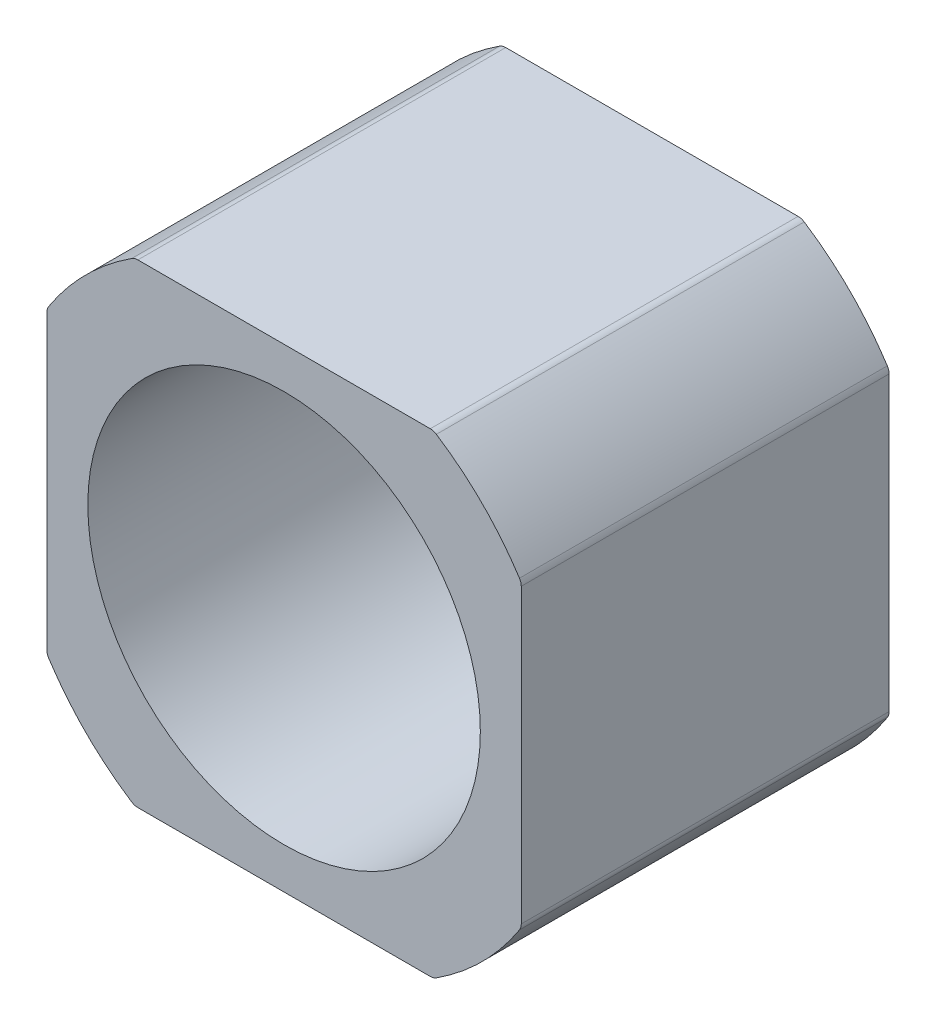
ISO-10303-21;
HEADER;
FILE_DESCRIPTION(('STEP AP214'),'2;1');
FILE_NAME('part.step','',(''),(''),'','','');
FILE_SCHEMA(('AUTOMOTIVE_DESIGN { 1 0 10303 214 1 1 1 1 }'));
ENDSEC;
DATA;
#1=APPLICATION_CONTEXT('core data for automotive mechanical design processes');
#2=APPLICATION_PROTOCOL_DEFINITION('international standard','automotive_design',2000,#1);
#3=PRODUCT_CONTEXT('',#1,'mechanical');
#4=PRODUCT('Part','Part','',(#3));
#5=PRODUCT_RELATED_PRODUCT_CATEGORY('part','',(#4));
#6=PRODUCT_DEFINITION_FORMATION('','',#4);
#7=PRODUCT_DEFINITION_CONTEXT('part definition',#1,'design');
#8=PRODUCT_DEFINITION('design','',#6,#7);
#9=PRODUCT_DEFINITION_SHAPE('','',#8);
#10=(LENGTH_UNIT() NAMED_UNIT(*) SI_UNIT(.MILLI.,.METRE.));
#11=(NAMED_UNIT(*) PLANE_ANGLE_UNIT() SI_UNIT($,.RADIAN.));
#12=(NAMED_UNIT(*) SI_UNIT($,.STERADIAN.) SOLID_ANGLE_UNIT());
#13=UNCERTAINTY_MEASURE_WITH_UNIT(LENGTH_MEASURE(1.E-05),#10,'distance_accuracy_value','');
#14=(GEOMETRIC_REPRESENTATION_CONTEXT(3) GLOBAL_UNCERTAINTY_ASSIGNED_CONTEXT((#13)) GLOBAL_UNIT_ASSIGNED_CONTEXT((#10,
#11,#12)) REPRESENTATION_CONTEXT('',''));
#15=CARTESIAN_POINT('',(0.,0.,0.));
#16=DIRECTION('',(0.,0.,1.));
#17=DIRECTION('',(1.,0.,0.));
#18=AXIS2_PLACEMENT_3D('',#15,#16,#17);
#19=CARTESIAN_POINT('',(21.15,21.15,32.8));
#20=DIRECTION('',(-1.,0.,0.));
#21=DIRECTION('',(0.,-1.,0.));
#22=AXIS2_PLACEMENT_3D('',#19,#20,#21);
#23=PLANE('',#22);
#24=DIRECTION('',(0.,1.,0.));
#25=VECTOR('',#24,1.);
#26=CARTESIAN_POINT('',(21.15,21.15,32.8));
#27=LINE('',#26,#25);
#28=CARTESIAN_POINT('',(21.15,-13.0375419462412,32.8));
#29=VERTEX_POINT('',#28);
#30=CARTESIAN_POINT('',(21.15,13.0375419462412,32.8));
#31=VERTEX_POINT('',#30);
#32=EDGE_CURVE('E225',#29,#31,#27,.T.);
#33=ORIENTED_EDGE('',*,*,#32,.F.);
#34=DIRECTION('',(0.,0.,-1.));
#35=VECTOR('',#34,1.);
#36=CARTESIAN_POINT('',(21.15,-13.0375419462412,0.));
#37=LINE('',#36,#35);
#38=CARTESIAN_POINT('',(21.15,-13.0375419462412,0.));
#39=VERTEX_POINT('',#38);
#40=EDGE_CURVE('E308',#29,#39,#37,.T.);
#41=ORIENTED_EDGE('',*,*,#40,.T.);
#42=DIRECTION('',(0.,1.,0.));
#43=VECTOR('',#42,1.);
#44=CARTESIAN_POINT('',(21.15,21.15,0.));
#45=LINE('',#44,#43);
#46=CARTESIAN_POINT('',(21.15,13.0375419462412,0.));
#47=VERTEX_POINT('',#46);
#48=EDGE_CURVE('E211',#39,#47,#45,.T.);
#49=ORIENTED_EDGE('',*,*,#48,.T.);
#50=DIRECTION('',(0.,0.,-1.));
#51=VECTOR('',#50,1.);
#52=CARTESIAN_POINT('',(21.15,13.0375419462412,32.8));
#53=LINE('',#52,#51);
#54=EDGE_CURVE('E305',#47,#31,#53,.F.);
#55=ORIENTED_EDGE('',*,*,#54,.T.);
#56=EDGE_LOOP('',(#33,#41,#49,#55));
#57=FACE_BOUND('',#56,.T.);
#58=ADVANCED_FACE('F39',(#57),#23,.F.);
#59=CARTESIAN_POINT('',(-21.15,21.15,32.8));
#60=DIRECTION('',(0.,-1.,0.));
#61=DIRECTION('',(1.,0.,0.));
#62=AXIS2_PLACEMENT_3D('',#59,#60,#61);
#63=PLANE('',#62);
#64=DIRECTION('',(-1.,0.,0.));
#65=VECTOR('',#64,1.);
#66=CARTESIAN_POINT('',(-21.15,21.15,0.));
#67=LINE('',#66,#65);
#68=CARTESIAN_POINT('',(13.0375419462413,21.15,0.));
#69=VERTEX_POINT('',#68);
#70=CARTESIAN_POINT('',(-13.0375419462413,21.15,0.));
#71=VERTEX_POINT('',#70);
#72=EDGE_CURVE('E215',#69,#71,#67,.T.);
#73=ORIENTED_EDGE('',*,*,#72,.T.);
#74=DIRECTION('',(0.,0.,-1.));
#75=VECTOR('',#74,1.);
#76=CARTESIAN_POINT('',(-13.0375419462413,21.15,32.8));
#77=LINE('',#76,#75);
#78=CARTESIAN_POINT('',(-13.0375419462413,21.15,32.8));
#79=VERTEX_POINT('',#78);
#80=EDGE_CURVE('E161',#71,#79,#77,.F.);
#81=ORIENTED_EDGE('',*,*,#80,.T.);
#82=DIRECTION('',(-1.,0.,0.));
#83=VECTOR('',#82,1.);
#84=CARTESIAN_POINT('',(-21.15,21.15,32.8));
#85=LINE('',#84,#83);
#86=CARTESIAN_POINT('',(13.0375419462413,21.15,32.8));
#87=VERTEX_POINT('',#86);
#88=EDGE_CURVE('E207',#87,#79,#85,.T.);
#89=ORIENTED_EDGE('',*,*,#88,.F.);
#90=DIRECTION('',(0.,0.,-1.));
#91=VECTOR('',#90,1.);
#92=CARTESIAN_POINT('',(13.0375419462413,21.15,0.));
#93=LINE('',#92,#91);
#94=EDGE_CURVE('E167',#87,#69,#93,.T.);
#95=ORIENTED_EDGE('',*,*,#94,.T.);
#96=EDGE_LOOP('',(#73,#81,#89,#95));
#97=FACE_BOUND('',#96,.T.);
#98=ADVANCED_FACE('F375',(#97),#63,.F.);
#99=CARTESIAN_POINT('',(-21.15,21.15,32.8));
#100=DIRECTION('',(1.,0.,0.));
#101=DIRECTION('',(0.,0.,-1.));
#102=AXIS2_PLACEMENT_3D('',#99,#100,#101);
#103=PLANE('',#102);
#104=DIRECTION('',(0.,-1.,0.));
#105=VECTOR('',#104,1.);
#106=CARTESIAN_POINT('',(-21.15,21.15,32.8));
#107=LINE('',#106,#105);
#108=CARTESIAN_POINT('',(-21.15,13.0375419462413,32.8));
#109=VERTEX_POINT('',#108);
#110=CARTESIAN_POINT('',(-21.15,-13.0375419462413,32.8));
#111=VERTEX_POINT('',#110);
#112=EDGE_CURVE('E202',#109,#111,#107,.T.);
#113=ORIENTED_EDGE('',*,*,#112,.F.);
#114=DIRECTION('',(0.,0.,-1.));
#115=VECTOR('',#114,1.);
#116=CARTESIAN_POINT('',(-21.15,13.0375419462413,0.));
#117=LINE('',#116,#115);
#118=CARTESIAN_POINT('',(-21.15,13.0375419462413,0.));
#119=VERTEX_POINT('',#118);
#120=EDGE_CURVE('E277',#109,#119,#117,.T.);
#121=ORIENTED_EDGE('',*,*,#120,.T.);
#122=DIRECTION('',(0.,-1.,0.));
#123=VECTOR('',#122,1.);
#124=CARTESIAN_POINT('',(-21.15,21.15,0.));
#125=LINE('',#124,#123);
#126=CARTESIAN_POINT('',(-21.15,-13.0375419462413,0.));
#127=VERTEX_POINT('',#126);
#128=EDGE_CURVE('E219',#119,#127,#125,.T.);
#129=ORIENTED_EDGE('',*,*,#128,.T.);
#130=DIRECTION('',(0.,0.,-1.));
#131=VECTOR('',#130,1.);
#132=CARTESIAN_POINT('',(-21.15,-13.0375419462413,32.8));
#133=LINE('',#132,#131);
#134=EDGE_CURVE('E272',#127,#111,#133,.F.);
#135=ORIENTED_EDGE('',*,*,#134,.T.);
#136=EDGE_LOOP('',(#113,#121,#129,#135));
#137=FACE_BOUND('',#136,.T.);
#138=ADVANCED_FACE('F377',(#137),#103,.F.);
#139=CARTESIAN_POINT('',(-21.15,-21.15,32.8));
#140=DIRECTION('',(0.,1.,0.));
#141=DIRECTION('',(0.,0.,1.));
#142=AXIS2_PLACEMENT_3D('',#139,#140,#141);
#143=PLANE('',#142);
#144=DIRECTION('',(1.,0.,0.));
#145=VECTOR('',#144,1.);
#146=CARTESIAN_POINT('',(-21.15,-21.15,32.8));
#147=LINE('',#146,#145);
#148=CARTESIAN_POINT('',(-13.0375419462412,-21.15,32.8));
#149=VERTEX_POINT('',#148);
#150=CARTESIAN_POINT('',(13.0375419462412,-21.15,32.8));
#151=VERTEX_POINT('',#150);
#152=EDGE_CURVE('E197',#149,#151,#147,.T.);
#153=ORIENTED_EDGE('',*,*,#152,.F.);
#154=DIRECTION('',(0.,0.,-1.));
#155=VECTOR('',#154,1.);
#156=CARTESIAN_POINT('',(-13.0375419462412,-21.15,0.));
#157=LINE('',#156,#155);
#158=CARTESIAN_POINT('',(-13.0375419462412,-21.15,0.));
#159=VERTEX_POINT('',#158);
#160=EDGE_CURVE('E296',#149,#159,#157,.T.);
#161=ORIENTED_EDGE('',*,*,#160,.T.);
#162=DIRECTION('',(1.,0.,0.));
#163=VECTOR('',#162,1.);
#164=CARTESIAN_POINT('',(-21.15,-21.15,0.));
#165=LINE('',#164,#163);
#166=CARTESIAN_POINT('',(13.0375419462412,-21.15,0.));
#167=VERTEX_POINT('',#166);
#168=EDGE_CURVE('E222',#159,#167,#165,.T.);
#169=ORIENTED_EDGE('',*,*,#168,.T.);
#170=DIRECTION('',(0.,0.,-1.));
#171=VECTOR('',#170,1.);
#172=CARTESIAN_POINT('',(13.0375419462412,-21.15,32.8));
#173=LINE('',#172,#171);
#174=EDGE_CURVE('E293',#167,#151,#173,.F.);
#175=ORIENTED_EDGE('',*,*,#174,.T.);
#176=EDGE_LOOP('',(#153,#161,#169,#175));
#177=FACE_BOUND('',#176,.T.);
#178=ADVANCED_FACE('F263',(#177),#143,.F.);
#179=CARTESIAN_POINT('',(0.,0.,32.8));
#180=DIRECTION('',(0.,0.,1.));
#181=DIRECTION('',(1.,0.,0.));
#182=AXIS2_PLACEMENT_3D('',#179,#180,#181);
#183=PLANE('',#182);
#184=CARTESIAN_POINT('',(0.,0.,32.8));
#185=DIRECTION('',(0.,0.,1.));
#186=DIRECTION('',(1.,0.,0.));
#187=AXIS2_PLACEMENT_3D('',#184,#185,#186);
#188=CIRCLE('',#187,17.5);
#189=CARTESIAN_POINT('',(17.5,0.,32.8));
#190=VERTEX_POINT('',#189);
#191=EDGE_CURVE('E246',#190,#190,#188,.T.);
#192=ORIENTED_EDGE('',*,*,#191,.F.);
#193=EDGE_LOOP('',(#192));
#194=FACE_BOUND('',#193,.T.);
#195=ORIENTED_EDGE('',*,*,#88,.T.);
#196=CARTESIAN_POINT('',(-13.0375419462413,20.15,32.8));
#197=DIRECTION('',(0.,0.,1.));
#198=DIRECTION('',(1.,0.,0.));
#199=AXIS2_PLACEMENT_3D('',#196,#197,#198);
#200=CIRCLE('',#199,1.);
#201=CARTESIAN_POINT('',(-13.580772860668,20.9895833333333,32.8));
#202=VERTEX_POINT('',#201);
#203=EDGE_CURVE('E266',#79,#202,#200,.T.);
#204=ORIENTED_EDGE('',*,*,#203,.T.);
#205=CARTESIAN_POINT('',(0.,0.,32.8));
#206=DIRECTION('',(0.,0.,1.));
#207=DIRECTION('',(1.,0.,0.));
#208=AXIS2_PLACEMENT_3D('',#205,#206,#207);
#209=CIRCLE('',#208,25.);
#210=CARTESIAN_POINT('',(-20.9895833333333,13.580772860668,32.8));
#211=VERTEX_POINT('',#210);
#212=EDGE_CURVE('E178',#202,#211,#209,.T.);
#213=ORIENTED_EDGE('',*,*,#212,.T.);
#214=CARTESIAN_POINT('',(-20.15,13.0375419462413,32.8));
#215=DIRECTION('',(0.,0.,1.));
#216=DIRECTION('',(1.,0.,0.));
#217=AXIS2_PLACEMENT_3D('',#214,#215,#216);
#218=CIRCLE('',#217,1.);
#219=EDGE_CURVE('E273',#211,#109,#218,.T.);
#220=ORIENTED_EDGE('',*,*,#219,.T.);
#221=ORIENTED_EDGE('',*,*,#112,.T.);
#222=CARTESIAN_POINT('',(-20.15,-13.0375419462413,32.8));
#223=DIRECTION('',(0.,0.,1.));
#224=DIRECTION('',(1.,0.,0.));
#225=AXIS2_PLACEMENT_3D('',#222,#223,#224);
#226=CIRCLE('',#225,1.);
#227=CARTESIAN_POINT('',(-20.9895833333333,-13.580772860668,32.8));
#228=VERTEX_POINT('',#227);
#229=EDGE_CURVE('E279',#111,#228,#226,.T.);
#230=ORIENTED_EDGE('',*,*,#229,.T.);
#231=CARTESIAN_POINT('',(-13.580772860668,-20.9895833333333,32.8));
#232=VERTEX_POINT('',#231);
#233=EDGE_CURVE('E240',#228,#232,#209,.T.);
#234=ORIENTED_EDGE('',*,*,#233,.T.);
#235=CARTESIAN_POINT('',(-13.0375419462412,-20.15,32.8));
#236=DIRECTION('',(0.,0.,1.));
#237=DIRECTION('',(1.,0.,0.));
#238=AXIS2_PLACEMENT_3D('',#235,#236,#237);
#239=CIRCLE('',#238,1.);
#240=EDGE_CURVE('E326',#232,#149,#239,.T.);
#241=ORIENTED_EDGE('',*,*,#240,.T.);
#242=ORIENTED_EDGE('',*,*,#152,.T.);
#243=CARTESIAN_POINT('',(13.0375419462412,-20.15,32.8));
#244=DIRECTION('',(0.,0.,1.));
#245=DIRECTION('',(1.,0.,0.));
#246=AXIS2_PLACEMENT_3D('',#243,#244,#245);
#247=CIRCLE('',#246,1.);
#248=CARTESIAN_POINT('',(13.580772860668,-20.9895833333333,32.8));
#249=VERTEX_POINT('',#248);
#250=EDGE_CURVE('E63',#151,#249,#247,.T.);
#251=ORIENTED_EDGE('',*,*,#250,.T.);
#252=CARTESIAN_POINT('',(20.9895833333333,-13.580772860668,32.8));
#253=VERTEX_POINT('',#252);
#254=EDGE_CURVE('E237',#249,#253,#209,.T.);
#255=ORIENTED_EDGE('',*,*,#254,.T.);
#256=CARTESIAN_POINT('',(20.15,-13.0375419462412,32.8));
#257=DIRECTION('',(0.,0.,1.));
#258=DIRECTION('',(1.,0.,0.));
#259=AXIS2_PLACEMENT_3D('',#256,#257,#258);
#260=CIRCLE('',#259,1.);
#261=EDGE_CURVE('E55',#253,#29,#260,.T.);
#262=ORIENTED_EDGE('',*,*,#261,.T.);
#263=ORIENTED_EDGE('',*,*,#32,.T.);
#264=CARTESIAN_POINT('',(20.15,13.0375419462412,32.8));
#265=DIRECTION('',(0.,0.,1.));
#266=DIRECTION('',(1.,0.,0.));
#267=AXIS2_PLACEMENT_3D('',#264,#265,#266);
#268=CIRCLE('',#267,1.);
#269=CARTESIAN_POINT('',(20.9895833333333,13.580772860668,32.8));
#270=VERTEX_POINT('',#269);
#271=EDGE_CURVE('E320',#31,#270,#268,.T.);
#272=ORIENTED_EDGE('',*,*,#271,.T.);
#273=CARTESIAN_POINT('',(13.580772860668,20.9895833333333,32.8));
#274=VERTEX_POINT('',#273);
#275=EDGE_CURVE('E245',#270,#274,#209,.T.);
#276=ORIENTED_EDGE('',*,*,#275,.T.);
#277=CARTESIAN_POINT('',(13.0375419462413,20.15,32.8));
#278=DIRECTION('',(0.,0.,1.));
#279=DIRECTION('',(1.,0.,0.));
#280=AXIS2_PLACEMENT_3D('',#277,#278,#279);
#281=CIRCLE('',#280,1.);
#282=EDGE_CURVE('E268',#274,#87,#281,.T.);
#283=ORIENTED_EDGE('',*,*,#282,.T.);
#284=EDGE_LOOP('',(#195,#204,#213,#220,#221,#230,#234,#241,#242,#251,#255,#262,#263,#272,#276,#283));
#285=FACE_BOUND('',#284,.T.);
#286=ADVANCED_FACE('F261',(#194,#285),#183,.T.);
#287=CARTESIAN_POINT('',(0.,0.,0.));
#288=DIRECTION('',(0.,0.,1.));
#289=DIRECTION('',(1.,0.,0.));
#290=AXIS2_PLACEMENT_3D('',#287,#288,#289);
#291=PLANE('',#290);
#292=CARTESIAN_POINT('',(0.,0.,0.));
#293=DIRECTION('',(0.,0.,1.));
#294=DIRECTION('',(1.,0.,0.));
#295=AXIS2_PLACEMENT_3D('',#292,#293,#294);
#296=CIRCLE('',#295,17.5);
#297=CARTESIAN_POINT('',(17.5,0.,0.));
#298=VERTEX_POINT('',#297);
#299=EDGE_CURVE('E241',#298,#298,#296,.T.);
#300=ORIENTED_EDGE('',*,*,#299,.T.);
#301=EDGE_LOOP('',(#300));
#302=FACE_BOUND('',#301,.T.);
#303=CARTESIAN_POINT('',(0.,0.,0.));
#304=DIRECTION('',(0.,0.,1.));
#305=DIRECTION('',(1.,0.,0.));
#306=AXIS2_PLACEMENT_3D('',#303,#304,#305);
#307=CIRCLE('',#306,25.);
#308=CARTESIAN_POINT('',(-13.580772860668,20.9895833333333,0.));
#309=VERTEX_POINT('',#308);
#310=CARTESIAN_POINT('',(-20.9895833333333,13.580772860668,0.));
#311=VERTEX_POINT('',#310);
#312=EDGE_CURVE('E175',#309,#311,#307,.T.);
#313=ORIENTED_EDGE('',*,*,#312,.F.);
#314=CARTESIAN_POINT('',(-13.0375419462413,20.15,0.));
#315=DIRECTION('',(0.,0.,1.));
#316=DIRECTION('',(1.,0.,0.));
#317=AXIS2_PLACEMENT_3D('',#314,#315,#316);
#318=CIRCLE('',#317,1.);
#319=EDGE_CURVE('E156',#309,#71,#318,.F.);
#320=ORIENTED_EDGE('',*,*,#319,.T.);
#321=ORIENTED_EDGE('',*,*,#72,.F.);
#322=CARTESIAN_POINT('',(13.0375419462413,20.15,0.));
#323=DIRECTION('',(0.,0.,1.));
#324=DIRECTION('',(1.,0.,0.));
#325=AXIS2_PLACEMENT_3D('',#322,#323,#324);
#326=CIRCLE('',#325,1.);
#327=CARTESIAN_POINT('',(13.580772860668,20.9895833333333,0.));
#328=VERTEX_POINT('',#327);
#329=EDGE_CURVE('E180',#69,#328,#326,.F.);
#330=ORIENTED_EDGE('',*,*,#329,.T.);
#331=CARTESIAN_POINT('',(0.,0.,0.));
#332=DIRECTION('',(0.,0.,1.));
#333=DIRECTION('',(1.,0.,0.));
#334=AXIS2_PLACEMENT_3D('',#331,#332,#333);
#335=CIRCLE('',#334,25.);
#336=CARTESIAN_POINT('',(20.9895833333333,13.580772860668,0.));
#337=VERTEX_POINT('',#336);
#338=EDGE_CURVE('E216',#337,#328,#335,.T.);
#339=ORIENTED_EDGE('',*,*,#338,.F.);
#340=CARTESIAN_POINT('',(20.15,13.0375419462412,0.));
#341=DIRECTION('',(0.,0.,1.));
#342=DIRECTION('',(1.,0.,0.));
#343=AXIS2_PLACEMENT_3D('',#340,#341,#342);
#344=CIRCLE('',#343,1.);
#345=EDGE_CURVE('E368',#337,#47,#344,.F.);
#346=ORIENTED_EDGE('',*,*,#345,.T.);
#347=ORIENTED_EDGE('',*,*,#48,.F.);
#348=CARTESIAN_POINT('',(20.15,-13.0375419462412,0.));
#349=DIRECTION('',(0.,0.,1.));
#350=DIRECTION('',(1.,0.,0.));
#351=AXIS2_PLACEMENT_3D('',#348,#349,#350);
#352=CIRCLE('',#351,1.);
#353=CARTESIAN_POINT('',(20.9895833333333,-13.580772860668,0.));
#354=VERTEX_POINT('',#353);
#355=EDGE_CURVE('E366',#39,#354,#352,.F.);
#356=ORIENTED_EDGE('',*,*,#355,.T.);
#357=CARTESIAN_POINT('',(13.580772860668,-20.9895833333333,0.));
#358=VERTEX_POINT('',#357);
#359=EDGE_CURVE('E189',#358,#354,#307,.T.);
#360=ORIENTED_EDGE('',*,*,#359,.F.);
#361=CARTESIAN_POINT('',(13.0375419462412,-20.15,0.));
#362=DIRECTION('',(0.,0.,1.));
#363=DIRECTION('',(1.,0.,0.));
#364=AXIS2_PLACEMENT_3D('',#361,#362,#363);
#365=CIRCLE('',#364,1.);
#366=EDGE_CURVE('E343',#358,#167,#365,.F.);
#367=ORIENTED_EDGE('',*,*,#366,.T.);
#368=ORIENTED_EDGE('',*,*,#168,.F.);
#369=CARTESIAN_POINT('',(-13.0375419462412,-20.15,0.));
#370=DIRECTION('',(0.,0.,1.));
#371=DIRECTION('',(1.,0.,0.));
#372=AXIS2_PLACEMENT_3D('',#369,#370,#371);
#373=CIRCLE('',#372,1.);
#374=CARTESIAN_POINT('',(-13.580772860668,-20.9895833333333,0.));
#375=VERTEX_POINT('',#374);
#376=EDGE_CURVE('E338',#159,#375,#373,.F.);
#377=ORIENTED_EDGE('',*,*,#376,.T.);
#378=CARTESIAN_POINT('',(-20.9895833333333,-13.580772860668,0.));
#379=VERTEX_POINT('',#378);
#380=EDGE_CURVE('E187',#379,#375,#307,.T.);
#381=ORIENTED_EDGE('',*,*,#380,.F.);
#382=CARTESIAN_POINT('',(-20.15,-13.0375419462413,0.));
#383=DIRECTION('',(0.,0.,1.));
#384=DIRECTION('',(1.,0.,0.));
#385=AXIS2_PLACEMENT_3D('',#382,#383,#384);
#386=CIRCLE('',#385,1.);
#387=EDGE_CURVE('E336',#379,#127,#386,.F.);
#388=ORIENTED_EDGE('',*,*,#387,.T.);
#389=ORIENTED_EDGE('',*,*,#128,.F.);
#390=CARTESIAN_POINT('',(-20.15,13.0375419462413,0.));
#391=DIRECTION('',(0.,0.,1.));
#392=DIRECTION('',(1.,0.,0.));
#393=AXIS2_PLACEMENT_3D('',#390,#391,#392);
#394=CIRCLE('',#393,1.);
#395=EDGE_CURVE('E168',#119,#311,#394,.F.);
#396=ORIENTED_EDGE('',*,*,#395,.T.);
#397=EDGE_LOOP('',(#313,#320,#321,#330,#339,#346,#347,#356,#360,#367,#368,#377,#381,#388,#389,#396));
#398=FACE_BOUND('',#397,.T.);
#399=ADVANCED_FACE('F183',(#302,#398),#291,.F.);
#400=CARTESIAN_POINT('',(0.,0.,0.));
#401=DIRECTION('',(0.,0.,1.));
#402=DIRECTION('',(1.,0.,0.));
#403=AXIS2_PLACEMENT_3D('',#400,#401,#402);
#404=CYLINDRICAL_SURFACE('',#403,25.);
#405=ORIENTED_EDGE('',*,*,#254,.F.);
#406=DIRECTION('',(0.,0.,1.));
#407=VECTOR('',#406,1.);
#408=CARTESIAN_POINT('',(13.580772860668,-20.9895833333333,0.));
#409=LINE('',#408,#407);
#410=EDGE_CURVE('E302',#249,#358,#409,.F.);
#411=ORIENTED_EDGE('',*,*,#410,.T.);
#412=ORIENTED_EDGE('',*,*,#359,.T.);
#413=DIRECTION('',(0.,0.,1.));
#414=VECTOR('',#413,1.);
#415=CARTESIAN_POINT('',(20.9895833333333,-13.580772860668,0.));
#416=LINE('',#415,#414);
#417=EDGE_CURVE('E299',#354,#253,#416,.T.);
#418=ORIENTED_EDGE('',*,*,#417,.T.);
#419=EDGE_LOOP('',(#405,#411,#412,#418));
#420=FACE_BOUND('',#419,.T.);
#421=ADVANCED_FACE('F426',(#420),#404,.T.);
#422=ORIENTED_EDGE('',*,*,#233,.F.);
#423=DIRECTION('',(0.,0.,1.));
#424=VECTOR('',#423,1.);
#425=CARTESIAN_POINT('',(-20.9895833333333,-13.580772860668,0.));
#426=LINE('',#425,#424);
#427=EDGE_CURVE('E289',#228,#379,#426,.F.);
#428=ORIENTED_EDGE('',*,*,#427,.T.);
#429=ORIENTED_EDGE('',*,*,#380,.T.);
#430=DIRECTION('',(0.,0.,1.));
#431=VECTOR('',#430,1.);
#432=CARTESIAN_POINT('',(-13.580772860668,-20.9895833333333,0.));
#433=LINE('',#432,#431);
#434=EDGE_CURVE('E285',#375,#232,#433,.T.);
#435=ORIENTED_EDGE('',*,*,#434,.T.);
#436=EDGE_LOOP('',(#422,#428,#429,#435));
#437=FACE_BOUND('',#436,.T.);
#438=ADVANCED_FACE('F330',(#437),#404,.T.);
#439=ORIENTED_EDGE('',*,*,#212,.F.);
#440=DIRECTION('',(0.,0.,1.));
#441=VECTOR('',#440,1.);
#442=CARTESIAN_POINT('',(-13.580772860668,20.9895833333333,0.));
#443=LINE('',#442,#441);
#444=EDGE_CURVE('E160',#202,#309,#443,.F.);
#445=ORIENTED_EDGE('',*,*,#444,.T.);
#446=ORIENTED_EDGE('',*,*,#312,.T.);
#447=DIRECTION('',(0.,0.,1.));
#448=VECTOR('',#447,1.);
#449=CARTESIAN_POINT('',(-20.9895833333333,13.580772860668,0.));
#450=LINE('',#449,#448);
#451=EDGE_CURVE('E181',#311,#211,#450,.T.);
#452=ORIENTED_EDGE('',*,*,#451,.T.);
#453=EDGE_LOOP('',(#439,#445,#446,#452));
#454=FACE_BOUND('',#453,.T.);
#455=ADVANCED_FACE('F173',(#454),#404,.T.);
#456=ORIENTED_EDGE('',*,*,#275,.F.);
#457=DIRECTION('',(0.,0.,1.));
#458=VECTOR('',#457,1.);
#459=CARTESIAN_POINT('',(20.9895833333333,13.580772860668,0.));
#460=LINE('',#459,#458);
#461=EDGE_CURVE('E11',#270,#337,#460,.F.);
#462=ORIENTED_EDGE('',*,*,#461,.T.);
#463=ORIENTED_EDGE('',*,*,#338,.T.);
#464=DIRECTION('',(0.,0.,1.));
#465=VECTOR('',#464,1.);
#466=CARTESIAN_POINT('',(13.580772860668,20.9895833333333,0.));
#467=LINE('',#466,#465);
#468=EDGE_CURVE('E48',#328,#274,#467,.T.);
#469=ORIENTED_EDGE('',*,*,#468,.T.);
#470=EDGE_LOOP('',(#456,#462,#463,#469));
#471=FACE_BOUND('',#470,.T.);
#472=ADVANCED_FACE('F315',(#471),#404,.T.);
#473=CARTESIAN_POINT('',(-13.0375419462413,20.15,0.));
#474=DIRECTION('',(0.,0.,1.));
#475=DIRECTION('',(1.,0.,0.));
#476=AXIS2_PLACEMENT_3D('',#473,#474,#475);
#477=CYLINDRICAL_SURFACE('',#476,1.);
#478=ORIENTED_EDGE('',*,*,#203,.F.);
#479=ORIENTED_EDGE('',*,*,#80,.F.);
#480=ORIENTED_EDGE('',*,*,#319,.F.);
#481=ORIENTED_EDGE('',*,*,#444,.F.);
#482=EDGE_LOOP('',(#478,#479,#480,#481));
#483=FACE_BOUND('',#482,.T.);
#484=ADVANCED_FACE('F159',(#483),#477,.T.);
#485=CARTESIAN_POINT('',(-20.15,13.0375419462413,0.));
#486=DIRECTION('',(0.,0.,1.));
#487=DIRECTION('',(1.,0.,0.));
#488=AXIS2_PLACEMENT_3D('',#485,#486,#487);
#489=CYLINDRICAL_SURFACE('',#488,1.);
#490=ORIENTED_EDGE('',*,*,#395,.F.);
#491=ORIENTED_EDGE('',*,*,#120,.F.);
#492=ORIENTED_EDGE('',*,*,#219,.F.);
#493=ORIENTED_EDGE('',*,*,#451,.F.);
#494=EDGE_LOOP('',(#490,#491,#492,#493));
#495=FACE_BOUND('',#494,.T.);
#496=ADVANCED_FACE('F390',(#495),#489,.T.);
#497=CARTESIAN_POINT('',(-20.15,-13.0375419462413,0.));
#498=DIRECTION('',(0.,0.,1.));
#499=DIRECTION('',(1.,0.,0.));
#500=AXIS2_PLACEMENT_3D('',#497,#498,#499);
#501=CYLINDRICAL_SURFACE('',#500,1.);
#502=ORIENTED_EDGE('',*,*,#229,.F.);
#503=ORIENTED_EDGE('',*,*,#134,.F.);
#504=ORIENTED_EDGE('',*,*,#387,.F.);
#505=ORIENTED_EDGE('',*,*,#427,.F.);
#506=EDGE_LOOP('',(#502,#503,#504,#505));
#507=FACE_BOUND('',#506,.T.);
#508=ADVANCED_FACE('F334',(#507),#501,.T.);
#509=CARTESIAN_POINT('',(-13.0375419462412,-20.15,0.));
#510=DIRECTION('',(0.,0.,1.));
#511=DIRECTION('',(1.,0.,0.));
#512=AXIS2_PLACEMENT_3D('',#509,#510,#511);
#513=CYLINDRICAL_SURFACE('',#512,1.);
#514=ORIENTED_EDGE('',*,*,#376,.F.);
#515=ORIENTED_EDGE('',*,*,#160,.F.);
#516=ORIENTED_EDGE('',*,*,#240,.F.);
#517=ORIENTED_EDGE('',*,*,#434,.F.);
#518=EDGE_LOOP('',(#514,#515,#516,#517));
#519=FACE_BOUND('',#518,.T.);
#520=ADVANCED_FACE('F396',(#519),#513,.T.);
#521=CARTESIAN_POINT('',(13.0375419462412,-20.15,0.));
#522=DIRECTION('',(0.,0.,1.));
#523=DIRECTION('',(1.,0.,0.));
#524=AXIS2_PLACEMENT_3D('',#521,#522,#523);
#525=CYLINDRICAL_SURFACE('',#524,1.);
#526=ORIENTED_EDGE('',*,*,#250,.F.);
#527=ORIENTED_EDGE('',*,*,#174,.F.);
#528=ORIENTED_EDGE('',*,*,#366,.F.);
#529=ORIENTED_EDGE('',*,*,#410,.F.);
#530=EDGE_LOOP('',(#526,#527,#528,#529));
#531=FACE_BOUND('',#530,.T.);
#532=ADVANCED_FACE('F399',(#531),#525,.T.);
#533=CARTESIAN_POINT('',(20.15,-13.0375419462412,0.));
#534=DIRECTION('',(0.,0.,1.));
#535=DIRECTION('',(1.,0.,0.));
#536=AXIS2_PLACEMENT_3D('',#533,#534,#535);
#537=CYLINDRICAL_SURFACE('',#536,1.);
#538=ORIENTED_EDGE('',*,*,#355,.F.);
#539=ORIENTED_EDGE('',*,*,#40,.F.);
#540=ORIENTED_EDGE('',*,*,#261,.F.);
#541=ORIENTED_EDGE('',*,*,#417,.F.);
#542=EDGE_LOOP('',(#538,#539,#540,#541));
#543=FACE_BOUND('',#542,.T.);
#544=ADVANCED_FACE('F365',(#543),#537,.T.);
#545=CARTESIAN_POINT('',(20.15,13.0375419462412,0.));
#546=DIRECTION('',(0.,0.,1.));
#547=DIRECTION('',(1.,0.,0.));
#548=AXIS2_PLACEMENT_3D('',#545,#546,#547);
#549=CYLINDRICAL_SURFACE('',#548,1.);
#550=ORIENTED_EDGE('',*,*,#271,.F.);
#551=ORIENTED_EDGE('',*,*,#54,.F.);
#552=ORIENTED_EDGE('',*,*,#345,.F.);
#553=ORIENTED_EDGE('',*,*,#461,.F.);
#554=EDGE_LOOP('',(#550,#551,#552,#553));
#555=FACE_BOUND('',#554,.T.);
#556=ADVANCED_FACE('F405',(#555),#549,.T.);
#557=CARTESIAN_POINT('',(13.0375419462413,20.15,0.));
#558=DIRECTION('',(0.,0.,1.));
#559=DIRECTION('',(1.,0.,0.));
#560=AXIS2_PLACEMENT_3D('',#557,#558,#559);
#561=CYLINDRICAL_SURFACE('',#560,1.);
#562=ORIENTED_EDGE('',*,*,#329,.F.);
#563=ORIENTED_EDGE('',*,*,#94,.F.);
#564=ORIENTED_EDGE('',*,*,#282,.F.);
#565=ORIENTED_EDGE('',*,*,#468,.F.);
#566=EDGE_LOOP('',(#562,#563,#564,#565));
#567=FACE_BOUND('',#566,.T.);
#568=ADVANCED_FACE('F41',(#567),#561,.T.);
#569=CARTESIAN_POINT('',(0.,0.,0.));
#570=DIRECTION('',(0.,0.,1.));
#571=DIRECTION('',(1.,0.,0.));
#572=AXIS2_PLACEMENT_3D('',#569,#570,#571);
#573=CYLINDRICAL_SURFACE('',#572,17.5);
#574=ORIENTED_EDGE('',*,*,#299,.F.);
#575=EDGE_LOOP('',(#574));
#576=FACE_BOUND('',#575,.T.);
#577=ORIENTED_EDGE('',*,*,#191,.T.);
#578=EDGE_LOOP('',(#577));
#579=FACE_BOUND('',#578,.T.);
#580=ADVANCED_FACE('F255',(#576,#579),#573,.F.);
#581=CLOSED_SHELL('',(#58,#98,#138,#178,#286,#399,#421,#438,#455,#472,#484,#496,#508,#520,#532,
#544,#556,#568,#580));
#582=MANIFOLD_SOLID_BREP('B2',#581);
#583=ADVANCED_BREP_SHAPE_REPRESENTATION('',(#18,#582),#14);
#584=SHAPE_DEFINITION_REPRESENTATION(#9,#583);
ENDSEC;
END-ISO-10303-21;
